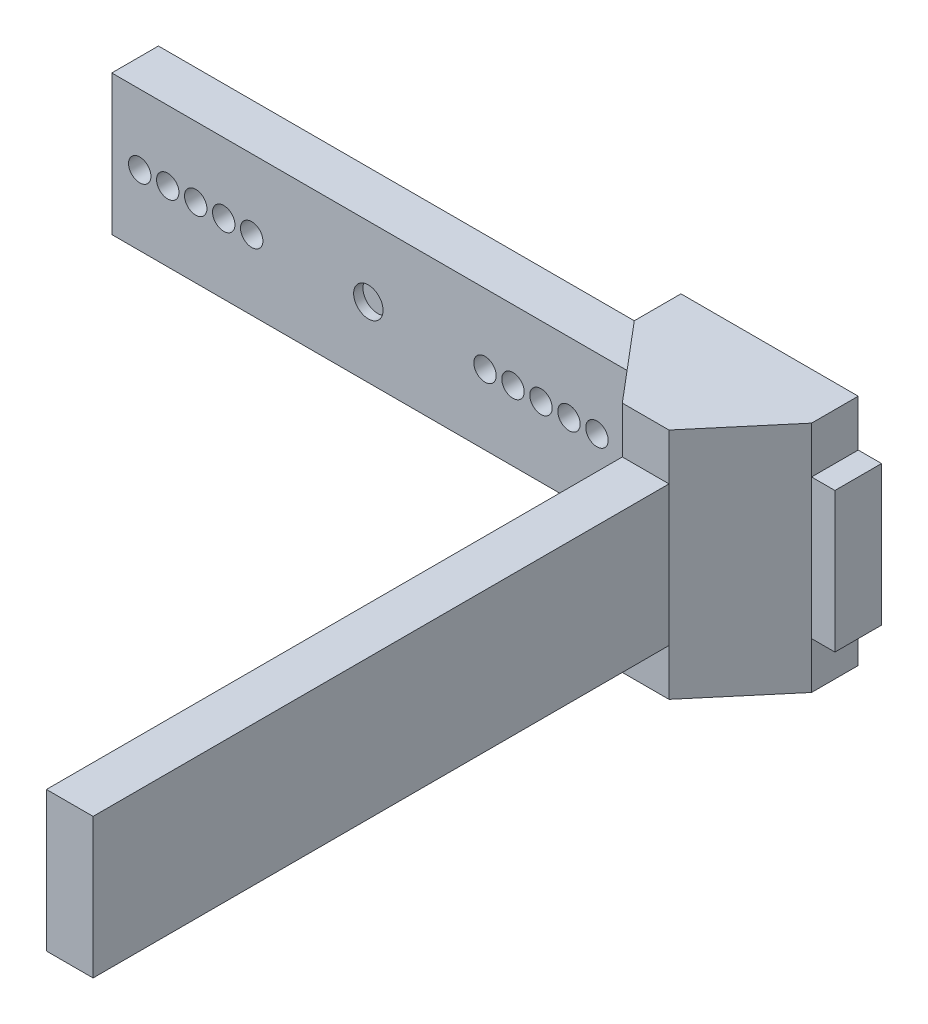
ISO-10303-21;
HEADER;
FILE_DESCRIPTION(('STEP AP214'),'2;1');
FILE_NAME('part.step','',(''),(''),'','','');
FILE_SCHEMA(('AUTOMOTIVE_DESIGN { 1 0 10303 214 1 1 1 1 }'));
ENDSEC;
DATA;
#1=APPLICATION_CONTEXT('core data for automotive mechanical design processes');
#2=APPLICATION_PROTOCOL_DEFINITION('international standard','automotive_design',2000,#1);
#3=PRODUCT_CONTEXT('',#1,'mechanical');
#4=PRODUCT('Part','Part','',(#3));
#5=PRODUCT_RELATED_PRODUCT_CATEGORY('part','',(#4));
#6=PRODUCT_DEFINITION_FORMATION('','',#4);
#7=PRODUCT_DEFINITION_CONTEXT('part definition',#1,'design');
#8=PRODUCT_DEFINITION('design','',#6,#7);
#9=PRODUCT_DEFINITION_SHAPE('','',#8);
#10=(LENGTH_UNIT() NAMED_UNIT(*) SI_UNIT(.MILLI.,.METRE.));
#11=(NAMED_UNIT(*) PLANE_ANGLE_UNIT() SI_UNIT($,.RADIAN.));
#12=(NAMED_UNIT(*) SI_UNIT($,.STERADIAN.) SOLID_ANGLE_UNIT());
#13=UNCERTAINTY_MEASURE_WITH_UNIT(LENGTH_MEASURE(1.E-05),#10,'distance_accuracy_value','');
#14=(GEOMETRIC_REPRESENTATION_CONTEXT(3) GLOBAL_UNCERTAINTY_ASSIGNED_CONTEXT((#13)) GLOBAL_UNIT_ASSIGNED_CONTEXT((#10,
#11,#12)) REPRESENTATION_CONTEXT('',''));
#15=CARTESIAN_POINT('',(0.,0.,0.));
#16=DIRECTION('',(0.,0.,1.));
#17=DIRECTION('',(1.,0.,0.));
#18=AXIS2_PLACEMENT_3D('',#15,#16,#17);
#19=CARTESIAN_POINT('',(0.,-7.5,5.));
#20=DIRECTION('',(0.,1.,0.));
#21=DIRECTION('',(0.,0.,1.));
#22=AXIS2_PLACEMENT_3D('',#19,#20,#21);
#23=PLANE('',#22);
#24=DIRECTION('',(0.,0.,-1.));
#25=VECTOR('',#24,1.);
#26=CARTESIAN_POINT('',(35.5,-7.5,75.));
#27=LINE('',#26,#25);
#28=CARTESIAN_POINT('',(35.5,-7.5,75.));
#29=VERTEX_POINT('',#28);
#30=CARTESIAN_POINT('',(35.5,-7.5,13.2821740244266));
#31=VERTEX_POINT('',#30);
#32=EDGE_CURVE('E276',#29,#31,#27,.T.);
#33=ORIENTED_EDGE('',*,*,#32,.T.);
#34=DIRECTION('',(1.,0.,0.));
#35=VECTOR('',#34,1.);
#36=CARTESIAN_POINT('',(40.5,-7.5,13.2821740244267));
#37=LINE('',#36,#35);
#38=CARTESIAN_POINT('',(40.5,-7.5,13.2821740244267));
#39=VERTEX_POINT('',#38);
#40=EDGE_CURVE('E173',#31,#39,#37,.T.);
#41=ORIENTED_EDGE('',*,*,#40,.T.);
#42=DIRECTION('',(0.,0.,-1.));
#43=VECTOR('',#42,1.);
#44=CARTESIAN_POINT('',(40.5,-7.5,75.));
#45=LINE('',#44,#43);
#46=CARTESIAN_POINT('',(40.5,-7.5,75.));
#47=VERTEX_POINT('',#46);
#48=EDGE_CURVE('E273',#47,#39,#45,.T.);
#49=ORIENTED_EDGE('',*,*,#48,.F.);
#50=DIRECTION('',(1.,0.,0.));
#51=VECTOR('',#50,1.);
#52=CARTESIAN_POINT('',(0.,-7.5,75.));
#53=LINE('',#52,#51);
#54=EDGE_CURVE('E271',#29,#47,#53,.T.);
#55=ORIENTED_EDGE('',*,*,#54,.F.);
#56=EDGE_LOOP('',(#33,#41,#49,#55));
#57=FACE_BOUND('',#56,.T.);
#58=ADVANCED_FACE('F40',(#57),#23,.F.);
#59=DIRECTION('',(1.,0.,0.));
#60=VECTOR('',#59,1.);
#61=CARTESIAN_POINT('',(0.,-7.5,5.));
#62=LINE('',#61,#60);
#63=CARTESIAN_POINT('',(47.5,-7.5,5.));
#64=VERTEX_POINT('',#63);
#65=CARTESIAN_POINT('',(50.,-7.5,5.));
#66=VERTEX_POINT('',#65);
#67=EDGE_CURVE('E299',#64,#66,#62,.T.);
#68=ORIENTED_EDGE('',*,*,#67,.F.);
#69=DIRECTION('',(0.,0.,-1.));
#70=VECTOR('',#69,1.);
#71=CARTESIAN_POINT('',(47.5,-7.5,0.));
#72=LINE('',#71,#70);
#73=CARTESIAN_POINT('',(47.5,-7.5,0.));
#74=VERTEX_POINT('',#73);
#75=EDGE_CURVE('E190',#64,#74,#72,.T.);
#76=ORIENTED_EDGE('',*,*,#75,.T.);
#77=DIRECTION('',(1.,0.,0.));
#78=VECTOR('',#77,1.);
#79=CARTESIAN_POINT('',(0.,-7.5,0.));
#80=LINE('',#79,#78);
#81=CARTESIAN_POINT('',(50.,-7.5,0.));
#82=VERTEX_POINT('',#81);
#83=EDGE_CURVE('E342',#74,#82,#80,.T.);
#84=ORIENTED_EDGE('',*,*,#83,.T.);
#85=DIRECTION('',(0.,0.,-1.));
#86=VECTOR('',#85,1.);
#87=CARTESIAN_POINT('',(50.,-7.5,5.));
#88=LINE('',#87,#86);
#89=EDGE_CURVE('E11',#66,#82,#88,.T.);
#90=ORIENTED_EDGE('',*,*,#89,.F.);
#91=EDGE_LOOP('',(#68,#76,#84,#90));
#92=FACE_BOUND('',#91,.T.);
#93=ADVANCED_FACE('F409',(#92),#23,.F.);
#94=CARTESIAN_POINT('',(0.,7.5,5.));
#95=DIRECTION('',(0.,1.,0.));
#96=DIRECTION('',(0.,0.,1.));
#97=AXIS2_PLACEMENT_3D('',#94,#95,#96);
#98=PLANE('',#97);
#99=DIRECTION('',(1.,0.,0.));
#100=VECTOR('',#99,1.);
#101=CARTESIAN_POINT('',(40.5,7.5,13.2821740244267));
#102=LINE('',#101,#100);
#103=CARTESIAN_POINT('',(35.5,7.5,13.2821740244266));
#104=VERTEX_POINT('',#103);
#105=CARTESIAN_POINT('',(40.5,7.5,13.2821740244267));
#106=VERTEX_POINT('',#105);
#107=EDGE_CURVE('E178',#104,#106,#102,.T.);
#108=ORIENTED_EDGE('',*,*,#107,.F.);
#109=DIRECTION('',(0.,0.,-1.));
#110=VECTOR('',#109,1.);
#111=CARTESIAN_POINT('',(35.5,7.5,75.));
#112=LINE('',#111,#110);
#113=CARTESIAN_POINT('',(35.5,7.5,75.));
#114=VERTEX_POINT('',#113);
#115=EDGE_CURVE('E279',#114,#104,#112,.T.);
#116=ORIENTED_EDGE('',*,*,#115,.F.);
#117=DIRECTION('',(-1.,0.,0.));
#118=VECTOR('',#117,1.);
#119=CARTESIAN_POINT('',(0.,7.5,75.));
#120=LINE('',#119,#118);
#121=CARTESIAN_POINT('',(40.5,7.5,75.));
#122=VERTEX_POINT('',#121);
#123=EDGE_CURVE('E267',#122,#114,#120,.T.);
#124=ORIENTED_EDGE('',*,*,#123,.F.);
#125=DIRECTION('',(0.,0.,-1.));
#126=VECTOR('',#125,1.);
#127=CARTESIAN_POINT('',(40.5,7.5,75.));
#128=LINE('',#127,#126);
#129=EDGE_CURVE('E282',#122,#106,#128,.T.);
#130=ORIENTED_EDGE('',*,*,#129,.T.);
#131=EDGE_LOOP('',(#108,#116,#124,#130));
#132=FACE_BOUND('',#131,.T.);
#133=ADVANCED_FACE('F441',(#132),#98,.T.);
#134=DIRECTION('',(0.,0.,1.));
#135=VECTOR('',#134,1.);
#136=CARTESIAN_POINT('',(28.5,7.5,5.));
#137=LINE('',#136,#135);
#138=CARTESIAN_POINT('',(28.5,7.5,0.));
#139=VERTEX_POINT('',#138);
#140=CARTESIAN_POINT('',(28.5,7.5,5.));
#141=VERTEX_POINT('',#140);
#142=EDGE_CURVE('E55',#139,#141,#137,.T.);
#143=ORIENTED_EDGE('',*,*,#142,.F.);
#144=DIRECTION('',(1.,0.,0.));
#145=VECTOR('',#144,1.);
#146=CARTESIAN_POINT('',(0.,7.5,0.));
#147=LINE('',#146,#145);
#148=CARTESIAN_POINT('',(-27.5,7.5,0.));
#149=VERTEX_POINT('',#148);
#150=EDGE_CURVE('E350',#149,#139,#147,.T.);
#151=ORIENTED_EDGE('',*,*,#150,.F.);
#152=DIRECTION('',(0.,0.,-1.));
#153=VECTOR('',#152,1.);
#154=CARTESIAN_POINT('',(-27.5,7.5,5.));
#155=LINE('',#154,#153);
#156=CARTESIAN_POINT('',(-27.5,7.5,5.));
#157=VERTEX_POINT('',#156);
#158=EDGE_CURVE('E379',#157,#149,#155,.T.);
#159=ORIENTED_EDGE('',*,*,#158,.F.);
#160=DIRECTION('',(1.,0.,0.));
#161=VECTOR('',#160,1.);
#162=CARTESIAN_POINT('',(0.,7.5,5.));
#163=LINE('',#162,#161);
#164=EDGE_CURVE('E307',#157,#141,#163,.T.);
#165=ORIENTED_EDGE('',*,*,#164,.T.);
#166=EDGE_LOOP('',(#143,#151,#159,#165));
#167=FACE_BOUND('',#166,.T.);
#168=ADVANCED_FACE('F423',(#167),#98,.T.);
#169=CARTESIAN_POINT('',(0.,0.,5.));
#170=DIRECTION('',(0.,0.,1.));
#171=DIRECTION('',(1.,0.,0.));
#172=AXIS2_PLACEMENT_3D('',#169,#170,#171);
#173=PLANE('',#172);
#174=CARTESIAN_POINT('',(47.5,7.5,5.));
#175=VERTEX_POINT('',#174);
#176=CARTESIAN_POINT('',(50.,7.5,5.));
#177=VERTEX_POINT('',#176);
#178=EDGE_CURVE('E306',#175,#177,#163,.T.);
#179=ORIENTED_EDGE('',*,*,#178,.F.);
#180=DIRECTION('',(0.,1.,0.));
#181=VECTOR('',#180,1.);
#182=CARTESIAN_POINT('',(47.5,-18.3440954703879,5.));
#183=LINE('',#182,#181);
#184=EDGE_CURVE('E256',#64,#175,#183,.T.);
#185=ORIENTED_EDGE('',*,*,#184,.F.);
#186=ORIENTED_EDGE('',*,*,#67,.T.);
#187=DIRECTION('',(0.,-1.,0.));
#188=VECTOR('',#187,1.);
#189=CARTESIAN_POINT('',(50.,0.,5.));
#190=LINE('',#189,#188);
#191=EDGE_CURVE('E303',#177,#66,#190,.T.);
#192=ORIENTED_EDGE('',*,*,#191,.F.);
#193=EDGE_LOOP('',(#179,#185,#186,#192));
#194=FACE_BOUND('',#193,.T.);
#195=ADVANCED_FACE('F407',(#194),#173,.T.);
#196=CARTESIAN_POINT('',(40.5,0.,75.));
#197=DIRECTION('',(1.,0.,0.));
#198=DIRECTION('',(0.,0.,-1.));
#199=AXIS2_PLACEMENT_3D('',#196,#197,#198);
#200=PLANE('',#199);
#201=ORIENTED_EDGE('',*,*,#48,.T.);
#202=DIRECTION('',(0.,1.,0.));
#203=VECTOR('',#202,1.);
#204=CARTESIAN_POINT('',(40.5,-18.3440954703879,13.2821740244266));
#205=LINE('',#204,#203);
#206=EDGE_CURVE('E255',#39,#106,#205,.T.);
#207=ORIENTED_EDGE('',*,*,#206,.T.);
#208=ORIENTED_EDGE('',*,*,#129,.F.);
#209=DIRECTION('',(0.,-1.,0.));
#210=VECTOR('',#209,1.);
#211=CARTESIAN_POINT('',(40.5,0.,75.));
#212=LINE('',#211,#210);
#213=EDGE_CURVE('E263',#122,#47,#212,.T.);
#214=ORIENTED_EDGE('',*,*,#213,.T.);
#215=EDGE_LOOP('',(#201,#207,#208,#214));
#216=FACE_BOUND('',#215,.T.);
#217=ADVANCED_FACE('F437',(#216),#200,.T.);
#218=CARTESIAN_POINT('',(-27.5,-7.5,0.));
#219=VERTEX_POINT('',#218);
#220=CARTESIAN_POINT('',(28.5,-7.5,0.));
#221=VERTEX_POINT('',#220);
#222=EDGE_CURVE('E343',#219,#221,#80,.T.);
#223=ORIENTED_EDGE('',*,*,#222,.T.);
#224=DIRECTION('',(0.,0.,1.));
#225=VECTOR('',#224,1.);
#226=CARTESIAN_POINT('',(28.5,-7.5,5.));
#227=LINE('',#226,#225);
#228=CARTESIAN_POINT('',(28.5,-7.5,5.));
#229=VERTEX_POINT('',#228);
#230=EDGE_CURVE('E207',#221,#229,#227,.T.);
#231=ORIENTED_EDGE('',*,*,#230,.T.);
#232=CARTESIAN_POINT('',(-27.5,-7.5,5.));
#233=VERTEX_POINT('',#232);
#234=EDGE_CURVE('E300',#233,#229,#62,.T.);
#235=ORIENTED_EDGE('',*,*,#234,.F.);
#236=DIRECTION('',(0.,0.,-1.));
#237=VECTOR('',#236,1.);
#238=CARTESIAN_POINT('',(-27.5,-7.5,5.));
#239=LINE('',#238,#237);
#240=EDGE_CURVE('E336',#233,#219,#239,.T.);
#241=ORIENTED_EDGE('',*,*,#240,.T.);
#242=EDGE_LOOP('',(#223,#231,#235,#241));
#243=FACE_BOUND('',#242,.T.);
#244=ADVANCED_FACE('F455',(#243),#23,.F.);
#245=CARTESIAN_POINT('',(50.,0.,5.));
#246=DIRECTION('',(1.,0.,0.));
#247=DIRECTION('',(0.,0.,-1.));
#248=AXIS2_PLACEMENT_3D('',#245,#246,#247);
#249=PLANE('',#248);
#250=DIRECTION('',(0.,-1.,0.));
#251=VECTOR('',#250,1.);
#252=CARTESIAN_POINT('',(50.,0.,0.));
#253=LINE('',#252,#251);
#254=CARTESIAN_POINT('',(50.,7.5,0.));
#255=VERTEX_POINT('',#254);
#256=EDGE_CURVE('E346',#255,#82,#253,.T.);
#257=ORIENTED_EDGE('',*,*,#256,.F.);
#258=DIRECTION('',(0.,0.,-1.));
#259=VECTOR('',#258,1.);
#260=CARTESIAN_POINT('',(50.,7.5,5.));
#261=LINE('',#260,#259);
#262=EDGE_CURVE('E48',#177,#255,#261,.T.);
#263=ORIENTED_EDGE('',*,*,#262,.F.);
#264=ORIENTED_EDGE('',*,*,#191,.T.);
#265=ORIENTED_EDGE('',*,*,#89,.T.);
#266=EDGE_LOOP('',(#257,#263,#264,#265));
#267=FACE_BOUND('',#266,.T.);
#268=ADVANCED_FACE('F386',(#267),#249,.T.);
#269=DIRECTION('',(0.,0.,-1.));
#270=VECTOR('',#269,1.);
#271=CARTESIAN_POINT('',(47.5,7.5,0.));
#272=LINE('',#271,#270);
#273=CARTESIAN_POINT('',(47.5,7.5,0.));
#274=VERTEX_POINT('',#273);
#275=EDGE_CURVE('E63',#175,#274,#272,.T.);
#276=ORIENTED_EDGE('',*,*,#275,.F.);
#277=ORIENTED_EDGE('',*,*,#178,.T.);
#278=ORIENTED_EDGE('',*,*,#262,.T.);
#279=EDGE_CURVE('E349',#274,#255,#147,.T.);
#280=ORIENTED_EDGE('',*,*,#279,.F.);
#281=EDGE_LOOP('',(#276,#277,#278,#280));
#282=FACE_BOUND('',#281,.T.);
#283=ADVANCED_FACE('F383',(#282),#98,.T.);
#284=CARTESIAN_POINT('',(-18.5000000000001,0.,5.));
#285=DIRECTION('',(0.,0.,-1.));
#286=DIRECTION('',(-1.,0.,0.));
#287=AXIS2_PLACEMENT_3D('',#284,#285,#286);
#288=CYLINDRICAL_SURFACE('',#287,1.2);
#289=CARTESIAN_POINT('',(-18.5000000000001,0.,5.));
#290=DIRECTION('',(0.,0.,1.));
#291=DIRECTION('',(1.,0.,0.));
#292=AXIS2_PLACEMENT_3D('',#289,#290,#291);
#293=CIRCLE('',#292,1.2);
#294=CARTESIAN_POINT('',(-17.3000000000001,0.,5.));
#295=VERTEX_POINT('',#294);
#296=EDGE_CURVE('E330',#295,#295,#293,.F.);
#297=ORIENTED_EDGE('',*,*,#296,.F.);
#298=EDGE_LOOP('',(#297));
#299=FACE_BOUND('',#298,.T.);
#300=CARTESIAN_POINT('',(-18.5000000000001,0.,0.));
#301=DIRECTION('',(0.,0.,1.));
#302=DIRECTION('',(1.,0.,0.));
#303=AXIS2_PLACEMENT_3D('',#300,#301,#302);
#304=CIRCLE('',#303,1.2);
#305=CARTESIAN_POINT('',(-17.3000000000001,0.,0.));
#306=VERTEX_POINT('',#305);
#307=EDGE_CURVE('E373',#306,#306,#304,.F.);
#308=ORIENTED_EDGE('',*,*,#307,.T.);
#309=EDGE_LOOP('',(#308));
#310=FACE_BOUND('',#309,.T.);
#311=ADVANCED_FACE('F475',(#299,#310),#288,.F.);
#312=CARTESIAN_POINT('',(-24.5000000000001,0.,5.));
#313=DIRECTION('',(0.,0.,-1.));
#314=DIRECTION('',(-1.,0.,0.));
#315=AXIS2_PLACEMENT_3D('',#312,#313,#314);
#316=CYLINDRICAL_SURFACE('',#315,1.2);
#317=CARTESIAN_POINT('',(-24.5000000000001,0.,5.));
#318=DIRECTION('',(0.,0.,1.));
#319=DIRECTION('',(1.,0.,0.));
#320=AXIS2_PLACEMENT_3D('',#317,#318,#319);
#321=CIRCLE('',#320,1.2);
#322=CARTESIAN_POINT('',(-23.3000000000001,0.,5.));
#323=VERTEX_POINT('',#322);
#324=EDGE_CURVE('E327',#323,#323,#321,.F.);
#325=ORIENTED_EDGE('',*,*,#324,.F.);
#326=EDGE_LOOP('',(#325));
#327=FACE_BOUND('',#326,.T.);
#328=CARTESIAN_POINT('',(-24.5000000000001,0.,0.));
#329=DIRECTION('',(0.,0.,1.));
#330=DIRECTION('',(1.,0.,0.));
#331=AXIS2_PLACEMENT_3D('',#328,#329,#330);
#332=CIRCLE('',#331,1.2);
#333=CARTESIAN_POINT('',(-23.3000000000001,0.,0.));
#334=VERTEX_POINT('',#333);
#335=EDGE_CURVE('E370',#334,#334,#332,.F.);
#336=ORIENTED_EDGE('',*,*,#335,.T.);
#337=EDGE_LOOP('',(#336));
#338=FACE_BOUND('',#337,.T.);
#339=ADVANCED_FACE('F479',(#327,#338),#316,.F.);
#340=CARTESIAN_POINT('',(12.5,0.,5.));
#341=DIRECTION('',(0.,0.,-1.));
#342=DIRECTION('',(-1.,0.,0.));
#343=AXIS2_PLACEMENT_3D('',#340,#341,#342);
#344=CYLINDRICAL_SURFACE('',#343,1.2);
#345=CARTESIAN_POINT('',(12.5,0.,5.));
#346=DIRECTION('',(0.,0.,1.));
#347=DIRECTION('',(1.,0.,0.));
#348=AXIS2_PLACEMENT_3D('',#345,#346,#347);
#349=CIRCLE('',#348,1.2);
#350=CARTESIAN_POINT('',(13.7,0.,5.));
#351=VERTEX_POINT('',#350);
#352=EDGE_CURVE('E324',#351,#351,#349,.T.);
#353=ORIENTED_EDGE('',*,*,#352,.T.);
#354=EDGE_LOOP('',(#353));
#355=FACE_BOUND('',#354,.T.);
#356=CARTESIAN_POINT('',(12.5,0.,0.));
#357=DIRECTION('',(0.,0.,1.));
#358=DIRECTION('',(1.,0.,0.));
#359=AXIS2_PLACEMENT_3D('',#356,#357,#358);
#360=CIRCLE('',#359,1.2);
#361=CARTESIAN_POINT('',(13.7,0.,0.));
#362=VERTEX_POINT('',#361);
#363=EDGE_CURVE('E367',#362,#362,#360,.T.);
#364=ORIENTED_EDGE('',*,*,#363,.F.);
#365=EDGE_LOOP('',(#364));
#366=FACE_BOUND('',#365,.T.);
#367=ADVANCED_FACE('F485',(#355,#366),#344,.F.);
#368=CARTESIAN_POINT('',(15.5,0.,5.));
#369=DIRECTION('',(0.,0.,-1.));
#370=DIRECTION('',(-1.,0.,0.));
#371=AXIS2_PLACEMENT_3D('',#368,#369,#370);
#372=CYLINDRICAL_SURFACE('',#371,1.2);
#373=CARTESIAN_POINT('',(15.5,0.,5.));
#374=DIRECTION('',(0.,0.,1.));
#375=DIRECTION('',(1.,0.,0.));
#376=AXIS2_PLACEMENT_3D('',#373,#374,#375);
#377=CIRCLE('',#376,1.2);
#378=CARTESIAN_POINT('',(16.7,0.,5.));
#379=VERTEX_POINT('',#378);
#380=EDGE_CURVE('E321',#379,#379,#377,.T.);
#381=ORIENTED_EDGE('',*,*,#380,.T.);
#382=EDGE_LOOP('',(#381));
#383=FACE_BOUND('',#382,.T.);
#384=CARTESIAN_POINT('',(15.5,0.,0.));
#385=DIRECTION('',(0.,0.,1.));
#386=DIRECTION('',(1.,0.,0.));
#387=AXIS2_PLACEMENT_3D('',#384,#385,#386);
#388=CIRCLE('',#387,1.2);
#389=CARTESIAN_POINT('',(16.7,0.,0.));
#390=VERTEX_POINT('',#389);
#391=EDGE_CURVE('E364',#390,#390,#388,.T.);
#392=ORIENTED_EDGE('',*,*,#391,.F.);
#393=EDGE_LOOP('',(#392));
#394=FACE_BOUND('',#393,.T.);
#395=ADVANCED_FACE('F496',(#383,#394),#372,.F.);
#396=CARTESIAN_POINT('',(18.5,0.,5.));
#397=DIRECTION('',(0.,0.,-1.));
#398=DIRECTION('',(-1.,0.,0.));
#399=AXIS2_PLACEMENT_3D('',#396,#397,#398);
#400=CYLINDRICAL_SURFACE('',#399,1.2);
#401=CARTESIAN_POINT('',(18.5,0.,5.));
#402=DIRECTION('',(0.,0.,1.));
#403=DIRECTION('',(1.,0.,0.));
#404=AXIS2_PLACEMENT_3D('',#401,#402,#403);
#405=CIRCLE('',#404,1.2);
#406=CARTESIAN_POINT('',(19.7,0.,5.));
#407=VERTEX_POINT('',#406);
#408=EDGE_CURVE('E318',#407,#407,#405,.T.);
#409=ORIENTED_EDGE('',*,*,#408,.T.);
#410=EDGE_LOOP('',(#409));
#411=FACE_BOUND('',#410,.T.);
#412=CARTESIAN_POINT('',(18.5,0.,0.));
#413=DIRECTION('',(0.,0.,1.));
#414=DIRECTION('',(1.,0.,0.));
#415=AXIS2_PLACEMENT_3D('',#412,#413,#414);
#416=CIRCLE('',#415,1.2);
#417=CARTESIAN_POINT('',(19.7,0.,0.));
#418=VERTEX_POINT('',#417);
#419=EDGE_CURVE('E361',#418,#418,#416,.T.);
#420=ORIENTED_EDGE('',*,*,#419,.F.);
#421=EDGE_LOOP('',(#420));
#422=FACE_BOUND('',#421,.T.);
#423=ADVANCED_FACE('F500',(#411,#422),#400,.F.);
#424=CARTESIAN_POINT('',(21.5,0.,5.));
#425=DIRECTION('',(0.,0.,-1.));
#426=DIRECTION('',(-1.,0.,0.));
#427=AXIS2_PLACEMENT_3D('',#424,#425,#426);
#428=CYLINDRICAL_SURFACE('',#427,1.2);
#429=CARTESIAN_POINT('',(21.5,0.,5.));
#430=DIRECTION('',(0.,0.,1.));
#431=DIRECTION('',(1.,0.,0.));
#432=AXIS2_PLACEMENT_3D('',#429,#430,#431);
#433=CIRCLE('',#432,1.2);
#434=CARTESIAN_POINT('',(22.7,0.,5.));
#435=VERTEX_POINT('',#434);
#436=EDGE_CURVE('E315',#435,#435,#433,.T.);
#437=ORIENTED_EDGE('',*,*,#436,.T.);
#438=EDGE_LOOP('',(#437));
#439=FACE_BOUND('',#438,.T.);
#440=CARTESIAN_POINT('',(21.5,0.,0.));
#441=DIRECTION('',(0.,0.,1.));
#442=DIRECTION('',(1.,0.,0.));
#443=AXIS2_PLACEMENT_3D('',#440,#441,#442);
#444=CIRCLE('',#443,1.2);
#445=CARTESIAN_POINT('',(22.7,0.,0.));
#446=VERTEX_POINT('',#445);
#447=EDGE_CURVE('E358',#446,#446,#444,.T.);
#448=ORIENTED_EDGE('',*,*,#447,.F.);
#449=EDGE_LOOP('',(#448));
#450=FACE_BOUND('',#449,.T.);
#451=ADVANCED_FACE('F504',(#439,#450),#428,.F.);
#452=CARTESIAN_POINT('',(24.5,0.,5.));
#453=DIRECTION('',(0.,0.,-1.));
#454=DIRECTION('',(-1.,0.,0.));
#455=AXIS2_PLACEMENT_3D('',#452,#453,#454);
#456=CYLINDRICAL_SURFACE('',#455,1.2);
#457=CARTESIAN_POINT('',(24.5,0.,5.));
#458=DIRECTION('',(0.,0.,1.));
#459=DIRECTION('',(1.,0.,0.));
#460=AXIS2_PLACEMENT_3D('',#457,#458,#459);
#461=CIRCLE('',#460,1.2);
#462=CARTESIAN_POINT('',(25.7,0.,5.));
#463=VERTEX_POINT('',#462);
#464=EDGE_CURVE('E312',#463,#463,#461,.T.);
#465=ORIENTED_EDGE('',*,*,#464,.T.);
#466=EDGE_LOOP('',(#465));
#467=FACE_BOUND('',#466,.T.);
#468=CARTESIAN_POINT('',(24.5,0.,0.));
#469=DIRECTION('',(0.,0.,1.));
#470=DIRECTION('',(1.,0.,0.));
#471=AXIS2_PLACEMENT_3D('',#468,#469,#470);
#472=CIRCLE('',#471,1.2);
#473=CARTESIAN_POINT('',(25.7,0.,0.));
#474=VERTEX_POINT('',#473);
#475=EDGE_CURVE('E355',#474,#474,#472,.T.);
#476=ORIENTED_EDGE('',*,*,#475,.F.);
#477=EDGE_LOOP('',(#476));
#478=FACE_BOUND('',#477,.T.);
#479=ADVANCED_FACE('F508',(#467,#478),#456,.F.);
#480=CARTESIAN_POINT('',(-27.5,0.,5.));
#481=DIRECTION('',(-1.,0.,0.));
#482=DIRECTION('',(0.,0.,1.));
#483=AXIS2_PLACEMENT_3D('',#480,#481,#482);
#484=PLANE('',#483);
#485=DIRECTION('',(0.,1.,0.));
#486=VECTOR('',#485,1.);
#487=CARTESIAN_POINT('',(-27.5,0.,0.));
#488=LINE('',#487,#486);
#489=EDGE_CURVE('E352',#219,#149,#488,.T.);
#490=ORIENTED_EDGE('',*,*,#489,.F.);
#491=ORIENTED_EDGE('',*,*,#240,.F.);
#492=DIRECTION('',(0.,1.,0.));
#493=VECTOR('',#492,1.);
#494=CARTESIAN_POINT('',(-27.5,0.,5.));
#495=LINE('',#494,#493);
#496=EDGE_CURVE('E309',#233,#157,#495,.T.);
#497=ORIENTED_EDGE('',*,*,#496,.T.);
#498=ORIENTED_EDGE('',*,*,#158,.T.);
#499=EDGE_LOOP('',(#490,#491,#497,#498));
#500=FACE_BOUND('',#499,.T.);
#501=ADVANCED_FACE('F419',(#500),#484,.T.);
#502=CARTESIAN_POINT('',(-21.5000000000001,0.,5.));
#503=DIRECTION('',(0.,0.,-1.));
#504=DIRECTION('',(-1.,0.,0.));
#505=AXIS2_PLACEMENT_3D('',#502,#503,#504);
#506=CYLINDRICAL_SURFACE('',#505,1.2);
#507=CARTESIAN_POINT('',(-21.5000000000001,0.,5.));
#508=DIRECTION('',(0.,0.,1.));
#509=DIRECTION('',(1.,0.,0.));
#510=AXIS2_PLACEMENT_3D('',#507,#508,#509);
#511=CIRCLE('',#510,1.2);
#512=CARTESIAN_POINT('',(-20.3000000000001,0.,5.));
#513=VERTEX_POINT('',#512);
#514=EDGE_CURVE('E295',#513,#513,#511,.F.);
#515=ORIENTED_EDGE('',*,*,#514,.F.);
#516=EDGE_LOOP('',(#515));
#517=FACE_BOUND('',#516,.T.);
#518=CARTESIAN_POINT('',(-21.5000000000001,0.,0.));
#519=DIRECTION('',(0.,0.,1.));
#520=DIRECTION('',(1.,0.,0.));
#521=AXIS2_PLACEMENT_3D('',#518,#519,#520);
#522=CIRCLE('',#521,1.2);
#523=CARTESIAN_POINT('',(-20.3000000000001,0.,0.));
#524=VERTEX_POINT('',#523);
#525=EDGE_CURVE('E339',#524,#524,#522,.F.);
#526=ORIENTED_EDGE('',*,*,#525,.T.);
#527=EDGE_LOOP('',(#526));
#528=FACE_BOUND('',#527,.T.);
#529=ADVANCED_FACE('F513',(#517,#528),#506,.F.);
#530=CARTESIAN_POINT('',(-15.5000000000001,0.,5.));
#531=DIRECTION('',(0.,0.,-1.));
#532=DIRECTION('',(-1.,0.,0.));
#533=AXIS2_PLACEMENT_3D('',#530,#531,#532);
#534=CYLINDRICAL_SURFACE('',#533,1.2);
#535=CARTESIAN_POINT('',(-15.5000000000001,0.,5.));
#536=DIRECTION('',(0.,0.,1.));
#537=DIRECTION('',(1.,0.,0.));
#538=AXIS2_PLACEMENT_3D('',#535,#536,#537);
#539=CIRCLE('',#538,1.2);
#540=CARTESIAN_POINT('',(-14.3000000000001,0.,5.));
#541=VERTEX_POINT('',#540);
#542=EDGE_CURVE('E292',#541,#541,#539,.F.);
#543=ORIENTED_EDGE('',*,*,#542,.F.);
#544=EDGE_LOOP('',(#543));
#545=FACE_BOUND('',#544,.T.);
#546=CARTESIAN_POINT('',(-15.5000000000001,0.,0.));
#547=DIRECTION('',(0.,0.,1.));
#548=DIRECTION('',(1.,0.,0.));
#549=AXIS2_PLACEMENT_3D('',#546,#547,#548);
#550=CIRCLE('',#549,1.2);
#551=CARTESIAN_POINT('',(-14.3000000000001,0.,0.));
#552=VERTEX_POINT('',#551);
#553=EDGE_CURVE('E289',#552,#552,#550,.F.);
#554=ORIENTED_EDGE('',*,*,#553,.T.);
#555=EDGE_LOOP('',(#554));
#556=FACE_BOUND('',#555,.T.);
#557=ADVANCED_FACE('F42',(#545,#556),#534,.F.);
#558=CARTESIAN_POINT('',(-12.5000000000001,0.,5.));
#559=DIRECTION('',(0.,0.,-1.));
#560=DIRECTION('',(-1.,0.,0.));
#561=AXIS2_PLACEMENT_3D('',#558,#559,#560);
#562=CYLINDRICAL_SURFACE('',#561,1.2);
#563=CARTESIAN_POINT('',(-12.5000000000001,0.,5.));
#564=DIRECTION('',(0.,0.,1.));
#565=DIRECTION('',(1.,0.,0.));
#566=AXIS2_PLACEMENT_3D('',#563,#564,#565);
#567=CIRCLE('',#566,1.2);
#568=CARTESIAN_POINT('',(-11.3000000000001,0.,5.));
#569=VERTEX_POINT('',#568);
#570=EDGE_CURVE('E333',#569,#569,#567,.F.);
#571=ORIENTED_EDGE('',*,*,#570,.F.);
#572=EDGE_LOOP('',(#571));
#573=FACE_BOUND('',#572,.T.);
#574=CARTESIAN_POINT('',(-12.5000000000001,0.,0.));
#575=DIRECTION('',(0.,0.,1.));
#576=DIRECTION('',(1.,0.,0.));
#577=AXIS2_PLACEMENT_3D('',#574,#575,#576);
#578=CIRCLE('',#577,1.2);
#579=CARTESIAN_POINT('',(-11.3000000000001,0.,0.));
#580=VERTEX_POINT('',#579);
#581=EDGE_CURVE('E296',#580,#580,#578,.F.);
#582=ORIENTED_EDGE('',*,*,#581,.T.);
#583=EDGE_LOOP('',(#582));
#584=FACE_BOUND('',#583,.T.);
#585=ADVANCED_FACE('F491',(#573,#584),#562,.F.);
#586=DIRECTION('',(0.,1.,0.));
#587=VECTOR('',#586,1.);
#588=CARTESIAN_POINT('',(28.5,-18.3440954703879,5.));
#589=LINE('',#588,#587);
#590=EDGE_CURVE('E259',#229,#141,#589,.T.);
#591=ORIENTED_EDGE('',*,*,#590,.T.);
#592=ORIENTED_EDGE('',*,*,#164,.F.);
#593=ORIENTED_EDGE('',*,*,#496,.F.);
#594=ORIENTED_EDGE('',*,*,#234,.T.);
#595=EDGE_LOOP('',(#591,#592,#593,#594));
#596=FACE_BOUND('',#595,.T.);
#597=CARTESIAN_POINT('',(0.,0.,5.));
#598=DIRECTION('',(0.,0.,1.));
#599=DIRECTION('',(1.,0.,0.));
#600=AXIS2_PLACEMENT_3D('',#597,#598,#599);
#601=CIRCLE('',#600,1.57740170170482);
#602=CARTESIAN_POINT('',(1.57740170170482,0.,5.));
#603=VERTEX_POINT('',#602);
#604=EDGE_CURVE('E285',#603,#603,#601,.T.);
#605=ORIENTED_EDGE('',*,*,#604,.F.);
#606=EDGE_LOOP('',(#605));
#607=FACE_BOUND('',#606,.T.);
#608=ORIENTED_EDGE('',*,*,#542,.T.);
#609=EDGE_LOOP('',(#608));
#610=FACE_BOUND('',#609,.T.);
#611=ORIENTED_EDGE('',*,*,#514,.T.);
#612=EDGE_LOOP('',(#611));
#613=FACE_BOUND('',#612,.T.);
#614=ORIENTED_EDGE('',*,*,#464,.F.);
#615=EDGE_LOOP('',(#614));
#616=FACE_BOUND('',#615,.T.);
#617=ORIENTED_EDGE('',*,*,#436,.F.);
#618=EDGE_LOOP('',(#617));
#619=FACE_BOUND('',#618,.T.);
#620=ORIENTED_EDGE('',*,*,#408,.F.);
#621=EDGE_LOOP('',(#620));
#622=FACE_BOUND('',#621,.T.);
#623=ORIENTED_EDGE('',*,*,#380,.F.);
#624=EDGE_LOOP('',(#623));
#625=FACE_BOUND('',#624,.T.);
#626=ORIENTED_EDGE('',*,*,#352,.F.);
#627=EDGE_LOOP('',(#626));
#628=FACE_BOUND('',#627,.T.);
#629=ORIENTED_EDGE('',*,*,#324,.T.);
#630=EDGE_LOOP('',(#629));
#631=FACE_BOUND('',#630,.T.);
#632=ORIENTED_EDGE('',*,*,#296,.T.);
#633=EDGE_LOOP('',(#632));
#634=FACE_BOUND('',#633,.T.);
#635=ORIENTED_EDGE('',*,*,#570,.T.);
#636=EDGE_LOOP('',(#635));
#637=FACE_BOUND('',#636,.T.);
#638=ADVANCED_FACE('F453',(#596,#607,#610,#613,#616,#619,#622,#625,#628,#631,#634,#637),#173,.T.);
#639=CARTESIAN_POINT('',(0.,0.,0.));
#640=DIRECTION('',(0.,0.,1.));
#641=DIRECTION('',(1.,0.,0.));
#642=AXIS2_PLACEMENT_3D('',#639,#640,#641);
#643=PLANE('',#642);
#644=ORIENTED_EDGE('',*,*,#553,.F.);
#645=EDGE_LOOP('',(#644));
#646=FACE_BOUND('',#645,.T.);
#647=ORIENTED_EDGE('',*,*,#525,.F.);
#648=EDGE_LOOP('',(#647));
#649=FACE_BOUND('',#648,.T.);
#650=ORIENTED_EDGE('',*,*,#222,.F.);
#651=ORIENTED_EDGE('',*,*,#489,.T.);
#652=ORIENTED_EDGE('',*,*,#150,.T.);
#653=DIRECTION('',(0.,-1.,0.));
#654=VECTOR('',#653,1.);
#655=CARTESIAN_POINT('',(28.5,12.5,0.));
#656=LINE('',#655,#654);
#657=CARTESIAN_POINT('',(28.5,12.5,0.));
#658=VERTEX_POINT('',#657);
#659=EDGE_CURVE('E243',#658,#139,#656,.T.);
#660=ORIENTED_EDGE('',*,*,#659,.F.);
#661=DIRECTION('',(-1.,0.,0.));
#662=VECTOR('',#661,1.);
#663=CARTESIAN_POINT('',(28.5,12.5,0.));
#664=LINE('',#663,#662);
#665=CARTESIAN_POINT('',(47.5,12.5,0.));
#666=VERTEX_POINT('',#665);
#667=EDGE_CURVE('E227',#666,#658,#664,.T.);
#668=ORIENTED_EDGE('',*,*,#667,.F.);
#669=DIRECTION('',(0.,-1.,0.));
#670=VECTOR('',#669,1.);
#671=CARTESIAN_POINT('',(47.5,12.5,0.));
#672=LINE('',#671,#670);
#673=EDGE_CURVE('E246',#666,#274,#672,.T.);
#674=ORIENTED_EDGE('',*,*,#673,.T.);
#675=ORIENTED_EDGE('',*,*,#279,.T.);
#676=ORIENTED_EDGE('',*,*,#256,.T.);
#677=ORIENTED_EDGE('',*,*,#83,.F.);
#678=DIRECTION('',(0.,1.,0.));
#679=VECTOR('',#678,1.);
#680=CARTESIAN_POINT('',(47.5,-12.5,0.));
#681=LINE('',#680,#679);
#682=CARTESIAN_POINT('',(47.5,-12.5,0.));
#683=VERTEX_POINT('',#682);
#684=EDGE_CURVE('E215',#683,#74,#681,.T.);
#685=ORIENTED_EDGE('',*,*,#684,.F.);
#686=DIRECTION('',(-1.,0.,0.));
#687=VECTOR('',#686,1.);
#688=CARTESIAN_POINT('',(28.5,-12.5,0.));
#689=LINE('',#688,#687);
#690=CARTESIAN_POINT('',(28.5,-12.5,0.));
#691=VERTEX_POINT('',#690);
#692=EDGE_CURVE('E196',#683,#691,#689,.T.);
#693=ORIENTED_EDGE('',*,*,#692,.T.);
#694=DIRECTION('',(0.,1.,0.));
#695=VECTOR('',#694,1.);
#696=CARTESIAN_POINT('',(28.5,-12.5,0.));
#697=LINE('',#696,#695);
#698=EDGE_CURVE('E217',#691,#221,#697,.T.);
#699=ORIENTED_EDGE('',*,*,#698,.T.);
#700=EDGE_LOOP('',(#650,#651,#652,#660,#668,#674,#675,#676,#677,#685,#693,#699));
#701=FACE_BOUND('',#700,.T.);
#702=ORIENTED_EDGE('',*,*,#475,.T.);
#703=EDGE_LOOP('',(#702));
#704=FACE_BOUND('',#703,.T.);
#705=ORIENTED_EDGE('',*,*,#447,.T.);
#706=EDGE_LOOP('',(#705));
#707=FACE_BOUND('',#706,.T.);
#708=ORIENTED_EDGE('',*,*,#419,.T.);
#709=EDGE_LOOP('',(#708));
#710=FACE_BOUND('',#709,.T.);
#711=ORIENTED_EDGE('',*,*,#391,.T.);
#712=EDGE_LOOP('',(#711));
#713=FACE_BOUND('',#712,.T.);
#714=ORIENTED_EDGE('',*,*,#363,.T.);
#715=EDGE_LOOP('',(#714));
#716=FACE_BOUND('',#715,.T.);
#717=ORIENTED_EDGE('',*,*,#335,.F.);
#718=EDGE_LOOP('',(#717));
#719=FACE_BOUND('',#718,.T.);
#720=ORIENTED_EDGE('',*,*,#307,.F.);
#721=EDGE_LOOP('',(#720));
#722=FACE_BOUND('',#721,.T.);
#723=ORIENTED_EDGE('',*,*,#581,.F.);
#724=EDGE_LOOP('',(#723));
#725=FACE_BOUND('',#724,.T.);
#726=ADVANCED_FACE('F391',(#646,#649,#701,#704,#707,#710,#713,#716,#719,#722,#725),#643,.F.);
#727=CARTESIAN_POINT('',(0.,0.,4.));
#728=DIRECTION('',(0.,0.,1.));
#729=DIRECTION('',(1.,0.,0.));
#730=AXIS2_PLACEMENT_3D('',#727,#728,#729);
#731=CYLINDRICAL_SURFACE('',#730,1.57740170170482);
#732=CARTESIAN_POINT('',(0.,0.,4.));
#733=DIRECTION('',(0.,0.,1.));
#734=DIRECTION('',(1.,0.,0.));
#735=AXIS2_PLACEMENT_3D('',#732,#733,#734);
#736=CIRCLE('',#735,1.57740170170482);
#737=CARTESIAN_POINT('',(1.57740170170482,0.,4.));
#738=VERTEX_POINT('',#737);
#739=EDGE_CURVE('E286',#738,#738,#736,.T.);
#740=ORIENTED_EDGE('',*,*,#739,.F.);
#741=EDGE_LOOP('',(#740));
#742=FACE_BOUND('',#741,.T.);
#743=ORIENTED_EDGE('',*,*,#604,.T.);
#744=EDGE_LOOP('',(#743));
#745=FACE_BOUND('',#744,.T.);
#746=ADVANCED_FACE('F527',(#742,#745),#731,.F.);
#747=CARTESIAN_POINT('',(0.,0.,4.));
#748=DIRECTION('',(0.,0.,1.));
#749=DIRECTION('',(1.,0.,0.));
#750=AXIS2_PLACEMENT_3D('',#747,#748,#749);
#751=PLANE('',#750);
#752=ORIENTED_EDGE('',*,*,#739,.T.);
#753=EDGE_LOOP('',(#752));
#754=FACE_BOUND('',#753,.T.);
#755=ADVANCED_FACE('F533',(#754),#751,.T.);
#756=CARTESIAN_POINT('',(35.5,0.,75.));
#757=DIRECTION('',(1.,0.,0.));
#758=DIRECTION('',(0.,0.,-1.));
#759=AXIS2_PLACEMENT_3D('',#756,#757,#758);
#760=PLANE('',#759);
#761=ORIENTED_EDGE('',*,*,#115,.T.);
#762=DIRECTION('',(0.,1.,0.));
#763=VECTOR('',#762,1.);
#764=CARTESIAN_POINT('',(35.5,-18.3440954703879,13.2821740244266));
#765=LINE('',#764,#763);
#766=EDGE_CURVE('E261',#31,#104,#765,.T.);
#767=ORIENTED_EDGE('',*,*,#766,.F.);
#768=ORIENTED_EDGE('',*,*,#32,.F.);
#769=DIRECTION('',(0.,-1.,0.));
#770=VECTOR('',#769,1.);
#771=CARTESIAN_POINT('',(35.5,0.,75.));
#772=LINE('',#771,#770);
#773=EDGE_CURVE('E269',#114,#29,#772,.T.);
#774=ORIENTED_EDGE('',*,*,#773,.F.);
#775=EDGE_LOOP('',(#761,#767,#768,#774));
#776=FACE_BOUND('',#775,.T.);
#777=ADVANCED_FACE('F451',(#776),#760,.F.);
#778=CARTESIAN_POINT('',(0.,0.,75.));
#779=DIRECTION('',(0.,0.,1.));
#780=DIRECTION('',(1.,0.,0.));
#781=AXIS2_PLACEMENT_3D('',#778,#779,#780);
#782=PLANE('',#781);
#783=ORIENTED_EDGE('',*,*,#213,.F.);
#784=ORIENTED_EDGE('',*,*,#123,.T.);
#785=ORIENTED_EDGE('',*,*,#773,.T.);
#786=ORIENTED_EDGE('',*,*,#54,.T.);
#787=EDGE_LOOP('',(#783,#784,#785,#786));
#788=FACE_BOUND('',#787,.T.);
#789=ADVANCED_FACE('F446',(#788),#782,.T.);
#790=CARTESIAN_POINT('',(28.5,-18.3440954703879,5.));
#791=DIRECTION('',(-0.763749641179651,0.,0.645512575863518));
#792=DIRECTION('',(0.645512575863518,0.,0.763749641179652));
#793=AXIS2_PLACEMENT_3D('',#790,#791,#792);
#794=PLANE('',#793);
#795=ORIENTED_EDGE('',*,*,#590,.F.);
#796=DIRECTION('',(0.,1.,0.));
#797=VECTOR('',#796,1.);
#798=CARTESIAN_POINT('',(28.5,-12.5,5.));
#799=LINE('',#798,#797);
#800=CARTESIAN_POINT('',(28.5,-12.5,5.));
#801=VERTEX_POINT('',#800);
#802=EDGE_CURVE('E179',#801,#229,#799,.T.);
#803=ORIENTED_EDGE('',*,*,#802,.F.);
#804=DIRECTION('',(0.645512575863518,0.,0.763749641179652));
#805=VECTOR('',#804,1.);
#806=CARTESIAN_POINT('',(35.5,-12.5,13.2821740244266));
#807=LINE('',#806,#805);
#808=CARTESIAN_POINT('',(35.5,-12.5,13.2821740244266));
#809=VERTEX_POINT('',#808);
#810=EDGE_CURVE('E185',#801,#809,#807,.T.);
#811=ORIENTED_EDGE('',*,*,#810,.T.);
#812=DIRECTION('',(0.,1.,0.));
#813=VECTOR('',#812,1.);
#814=CARTESIAN_POINT('',(35.5,-12.5,13.2821740244266));
#815=LINE('',#814,#813);
#816=EDGE_CURVE('E167',#809,#31,#815,.T.);
#817=ORIENTED_EDGE('',*,*,#816,.T.);
#818=ORIENTED_EDGE('',*,*,#766,.T.);
#819=DIRECTION('',(0.,-1.,0.));
#820=VECTOR('',#819,1.);
#821=CARTESIAN_POINT('',(35.5,12.5,13.2821740244266));
#822=LINE('',#821,#820);
#823=CARTESIAN_POINT('',(35.5,12.5,13.2821740244266));
#824=VERTEX_POINT('',#823);
#825=EDGE_CURVE('E233',#824,#104,#822,.T.);
#826=ORIENTED_EDGE('',*,*,#825,.F.);
#827=DIRECTION('',(0.645512575863518,0.,0.763749641179652));
#828=VECTOR('',#827,1.);
#829=CARTESIAN_POINT('',(35.5,12.5,13.2821740244266));
#830=LINE('',#829,#828);
#831=CARTESIAN_POINT('',(28.5,12.5,5.));
#832=VERTEX_POINT('',#831);
#833=EDGE_CURVE('E231',#832,#824,#830,.T.);
#834=ORIENTED_EDGE('',*,*,#833,.F.);
#835=DIRECTION('',(0.,-1.,0.));
#836=VECTOR('',#835,1.);
#837=CARTESIAN_POINT('',(28.5,12.5,5.));
#838=LINE('',#837,#836);
#839=EDGE_CURVE('E240',#832,#141,#838,.T.);
#840=ORIENTED_EDGE('',*,*,#839,.T.);
#841=EDGE_LOOP('',(#795,#803,#811,#817,#818,#826,#834,#840));
#842=FACE_BOUND('',#841,.T.);
#843=ADVANCED_FACE('F193',(#842),#794,.T.);
#844=CARTESIAN_POINT('',(47.5,-18.3440954703879,5.));
#845=DIRECTION('',(-0.763749641179651,0.,-0.645512575863518));
#846=DIRECTION('',(-0.645512575863518,0.,0.763749641179652));
#847=AXIS2_PLACEMENT_3D('',#844,#845,#846);
#848=PLANE('',#847);
#849=ORIENTED_EDGE('',*,*,#206,.F.);
#850=DIRECTION('',(0.,1.,0.));
#851=VECTOR('',#850,1.);
#852=CARTESIAN_POINT('',(40.5,-12.5,13.2821740244267));
#853=LINE('',#852,#851);
#854=CARTESIAN_POINT('',(40.5,-12.5,13.2821740244267));
#855=VERTEX_POINT('',#854);
#856=EDGE_CURVE('E205',#855,#39,#853,.T.);
#857=ORIENTED_EDGE('',*,*,#856,.F.);
#858=DIRECTION('',(0.645512575863517,0.,-0.763749641179652));
#859=VECTOR('',#858,1.);
#860=CARTESIAN_POINT('',(47.5,-12.5,5.));
#861=LINE('',#860,#859);
#862=CARTESIAN_POINT('',(47.5,-12.5,5.));
#863=VERTEX_POINT('',#862);
#864=EDGE_CURVE('E189',#855,#863,#861,.T.);
#865=ORIENTED_EDGE('',*,*,#864,.T.);
#866=DIRECTION('',(0.,1.,0.));
#867=VECTOR('',#866,1.);
#868=CARTESIAN_POINT('',(47.5,-12.5,5.));
#869=LINE('',#868,#867);
#870=EDGE_CURVE('E213',#863,#64,#869,.T.);
#871=ORIENTED_EDGE('',*,*,#870,.T.);
#872=ORIENTED_EDGE('',*,*,#184,.T.);
#873=DIRECTION('',(0.,-1.,0.));
#874=VECTOR('',#873,1.);
#875=CARTESIAN_POINT('',(47.5,12.5,5.));
#876=LINE('',#875,#874);
#877=CARTESIAN_POINT('',(47.5,12.5,5.));
#878=VERTEX_POINT('',#877);
#879=EDGE_CURVE('E249',#878,#175,#876,.T.);
#880=ORIENTED_EDGE('',*,*,#879,.F.);
#881=DIRECTION('',(0.645512575863517,0.,-0.763749641179652));
#882=VECTOR('',#881,1.);
#883=CARTESIAN_POINT('',(47.5,12.5,5.));
#884=LINE('',#883,#882);
#885=CARTESIAN_POINT('',(40.5,12.5,13.2821740244267));
#886=VERTEX_POINT('',#885);
#887=EDGE_CURVE('E223',#886,#878,#884,.T.);
#888=ORIENTED_EDGE('',*,*,#887,.F.);
#889=DIRECTION('',(0.,-1.,0.));
#890=VECTOR('',#889,1.);
#891=CARTESIAN_POINT('',(40.5,12.5,13.2821740244267));
#892=LINE('',#891,#890);
#893=EDGE_CURVE('E252',#886,#106,#892,.T.);
#894=ORIENTED_EDGE('',*,*,#893,.T.);
#895=EDGE_LOOP('',(#849,#857,#865,#871,#872,#880,#888,#894));
#896=FACE_BOUND('',#895,.T.);
#897=ADVANCED_FACE('F402',(#896),#848,.F.);
#898=CARTESIAN_POINT('',(40.5,12.5,13.2821740244267));
#899=DIRECTION('',(0.,0.,-1.));
#900=DIRECTION('',(-1.,0.,0.));
#901=AXIS2_PLACEMENT_3D('',#898,#899,#900);
#902=PLANE('',#901);
#903=ORIENTED_EDGE('',*,*,#107,.T.);
#904=ORIENTED_EDGE('',*,*,#893,.F.);
#905=DIRECTION('',(1.,0.,0.));
#906=VECTOR('',#905,1.);
#907=CARTESIAN_POINT('',(40.5,12.5,13.2821740244267));
#908=LINE('',#907,#906);
#909=EDGE_CURVE('E220',#824,#886,#908,.T.);
#910=ORIENTED_EDGE('',*,*,#909,.F.);
#911=ORIENTED_EDGE('',*,*,#825,.T.);
#912=EDGE_LOOP('',(#903,#904,#910,#911));
#913=FACE_BOUND('',#912,.T.);
#914=ADVANCED_FACE('F435',(#913),#902,.F.);
#915=CARTESIAN_POINT('',(47.5,12.5,0.));
#916=DIRECTION('',(-1.,0.,0.));
#917=DIRECTION('',(0.,0.,1.));
#918=AXIS2_PLACEMENT_3D('',#915,#916,#917);
#919=PLANE('',#918);
#920=ORIENTED_EDGE('',*,*,#275,.T.);
#921=ORIENTED_EDGE('',*,*,#673,.F.);
#922=DIRECTION('',(0.,0.,-1.));
#923=VECTOR('',#922,1.);
#924=CARTESIAN_POINT('',(47.5,12.5,0.));
#925=LINE('',#924,#923);
#926=EDGE_CURVE('E225',#878,#666,#925,.T.);
#927=ORIENTED_EDGE('',*,*,#926,.F.);
#928=ORIENTED_EDGE('',*,*,#879,.T.);
#929=EDGE_LOOP('',(#920,#921,#927,#928));
#930=FACE_BOUND('',#929,.T.);
#931=ADVANCED_FACE('F398',(#930),#919,.F.);
#932=CARTESIAN_POINT('',(28.5,12.5,5.));
#933=DIRECTION('',(1.,0.,0.));
#934=DIRECTION('',(0.,0.,-1.));
#935=AXIS2_PLACEMENT_3D('',#932,#933,#934);
#936=PLANE('',#935);
#937=ORIENTED_EDGE('',*,*,#142,.T.);
#938=ORIENTED_EDGE('',*,*,#839,.F.);
#939=DIRECTION('',(0.,0.,1.));
#940=VECTOR('',#939,1.);
#941=CARTESIAN_POINT('',(28.5,12.5,5.));
#942=LINE('',#941,#940);
#943=EDGE_CURVE('E229',#658,#832,#942,.T.);
#944=ORIENTED_EDGE('',*,*,#943,.F.);
#945=ORIENTED_EDGE('',*,*,#659,.T.);
#946=EDGE_LOOP('',(#937,#938,#944,#945));
#947=FACE_BOUND('',#946,.T.);
#948=ADVANCED_FACE('F426',(#947),#936,.F.);
#949=CARTESIAN_POINT('',(0.,12.5,0.));
#950=DIRECTION('',(0.,-1.,0.));
#951=DIRECTION('',(0.,0.,-1.));
#952=AXIS2_PLACEMENT_3D('',#949,#950,#951);
#953=PLANE('',#952);
#954=ORIENTED_EDGE('',*,*,#909,.T.);
#955=ORIENTED_EDGE('',*,*,#887,.T.);
#956=ORIENTED_EDGE('',*,*,#926,.T.);
#957=ORIENTED_EDGE('',*,*,#667,.T.);
#958=ORIENTED_EDGE('',*,*,#943,.T.);
#959=ORIENTED_EDGE('',*,*,#833,.T.);
#960=EDGE_LOOP('',(#954,#955,#956,#957,#958,#959));
#961=FACE_BOUND('',#960,.T.);
#962=ADVANCED_FACE('F430',(#961),#953,.F.);
#963=CARTESIAN_POINT('',(40.5,-12.5,13.2821740244267));
#964=DIRECTION('',(0.,0.,1.));
#965=DIRECTION('',(1.,0.,0.));
#966=AXIS2_PLACEMENT_3D('',#963,#964,#965);
#967=PLANE('',#966);
#968=ORIENTED_EDGE('',*,*,#40,.F.);
#969=ORIENTED_EDGE('',*,*,#816,.F.);
#970=DIRECTION('',(1.,0.,0.));
#971=VECTOR('',#970,1.);
#972=CARTESIAN_POINT('',(40.5,-12.5,13.2821740244267));
#973=LINE('',#972,#971);
#974=EDGE_CURVE('E170',#809,#855,#973,.T.);
#975=ORIENTED_EDGE('',*,*,#974,.T.);
#976=ORIENTED_EDGE('',*,*,#856,.T.);
#977=EDGE_LOOP('',(#968,#969,#975,#976));
#978=FACE_BOUND('',#977,.T.);
#979=ADVANCED_FACE('F169',(#978),#967,.T.);
#980=CARTESIAN_POINT('',(28.5,-12.5,5.));
#981=DIRECTION('',(-1.,0.,0.));
#982=DIRECTION('',(0.,0.,1.));
#983=AXIS2_PLACEMENT_3D('',#980,#981,#982);
#984=PLANE('',#983);
#985=ORIENTED_EDGE('',*,*,#230,.F.);
#986=ORIENTED_EDGE('',*,*,#698,.F.);
#987=DIRECTION('',(0.,0.,1.));
#988=VECTOR('',#987,1.);
#989=CARTESIAN_POINT('',(28.5,-12.5,5.));
#990=LINE('',#989,#988);
#991=EDGE_CURVE('E194',#691,#801,#990,.T.);
#992=ORIENTED_EDGE('',*,*,#991,.T.);
#993=ORIENTED_EDGE('',*,*,#802,.T.);
#994=EDGE_LOOP('',(#985,#986,#992,#993));
#995=FACE_BOUND('',#994,.T.);
#996=ADVANCED_FACE('F415',(#995),#984,.T.);
#997=CARTESIAN_POINT('',(47.5,-12.5,0.));
#998=DIRECTION('',(1.,0.,0.));
#999=DIRECTION('',(0.,0.,-1.));
#1000=AXIS2_PLACEMENT_3D('',#997,#998,#999);
#1001=PLANE('',#1000);
#1002=ORIENTED_EDGE('',*,*,#75,.F.);
#1003=ORIENTED_EDGE('',*,*,#870,.F.);
#1004=DIRECTION('',(0.,0.,-1.));
#1005=VECTOR('',#1004,1.);
#1006=CARTESIAN_POINT('',(47.5,-12.5,0.));
#1007=LINE('',#1006,#1005);
#1008=EDGE_CURVE('E201',#863,#683,#1007,.T.);
#1009=ORIENTED_EDGE('',*,*,#1008,.T.);
#1010=ORIENTED_EDGE('',*,*,#684,.T.);
#1011=EDGE_LOOP('',(#1002,#1003,#1009,#1010));
#1012=FACE_BOUND('',#1011,.T.);
#1013=ADVANCED_FACE('F411',(#1012),#1001,.T.);
#1014=CARTESIAN_POINT('',(0.,-12.5,0.));
#1015=DIRECTION('',(0.,1.,0.));
#1016=DIRECTION('',(0.,0.,-1.));
#1017=AXIS2_PLACEMENT_3D('',#1014,#1015,#1016);
#1018=PLANE('',#1017);
#1019=ORIENTED_EDGE('',*,*,#974,.F.);
#1020=ORIENTED_EDGE('',*,*,#810,.F.);
#1021=ORIENTED_EDGE('',*,*,#991,.F.);
#1022=ORIENTED_EDGE('',*,*,#692,.F.);
#1023=ORIENTED_EDGE('',*,*,#1008,.F.);
#1024=ORIENTED_EDGE('',*,*,#864,.F.);
#1025=EDGE_LOOP('',(#1019,#1020,#1021,#1022,#1023,#1024));
#1026=FACE_BOUND('',#1025,.T.);
#1027=ADVANCED_FACE('F183',(#1026),#1018,.F.);
#1028=CLOSED_SHELL('',(#58,#93,#133,#168,#195,#217,#244,#268,#283,#311,#339,#367,#395,#423,#451,
#479,#501,#529,#557,#585,#638,#726,#746,#755,#777,#789,#843,#897,#914,#931,#948,#962,#979,#996,
#1013,#1027));
#1029=MANIFOLD_SOLID_BREP('B2',#1028);
#1030=ADVANCED_BREP_SHAPE_REPRESENTATION('',(#18,#1029),#14);
#1031=SHAPE_DEFINITION_REPRESENTATION(#9,#1030);
ENDSEC;
END-ISO-10303-21;
